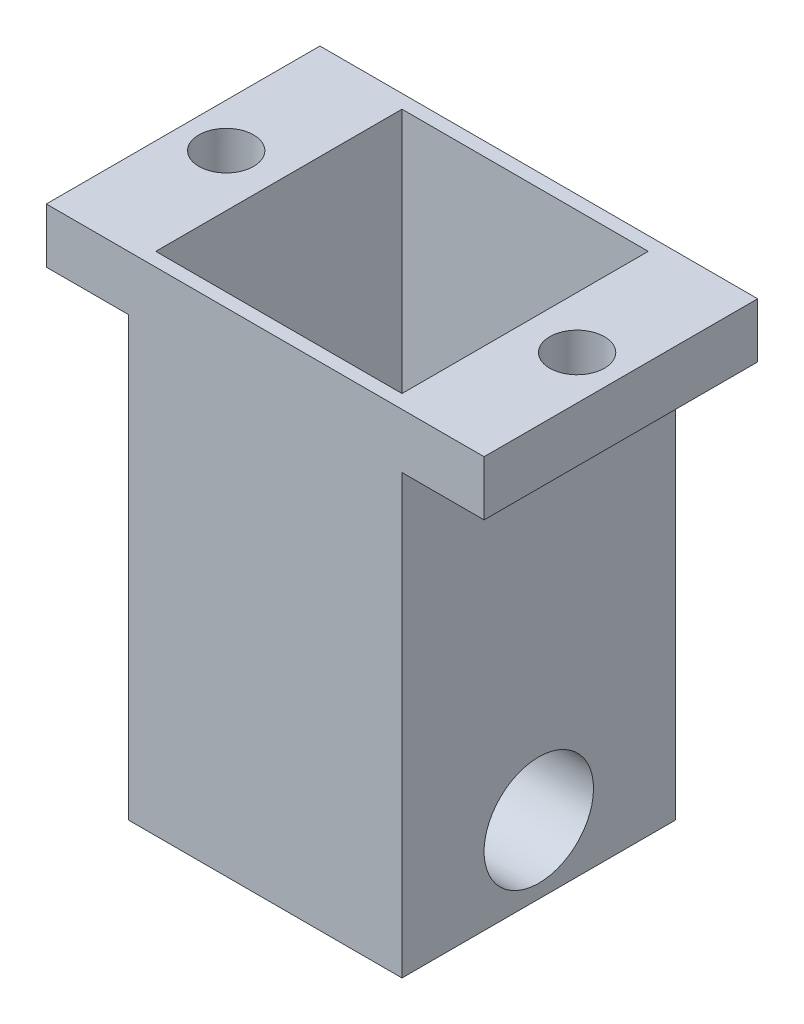
ISO-10303-21;
HEADER;
FILE_DESCRIPTION(('STEP AP214'),'2;1');
FILE_NAME('part.step','',(''),(''),'','','');
FILE_SCHEMA(('AUTOMOTIVE_DESIGN { 1 0 10303 214 1 1 1 1 }'));
ENDSEC;
DATA;
#1=APPLICATION_CONTEXT('core data for automotive mechanical design processes');
#2=APPLICATION_PROTOCOL_DEFINITION('international standard','automotive_design',2000,#1);
#3=PRODUCT_CONTEXT('',#1,'mechanical');
#4=PRODUCT('Part','Part','',(#3));
#5=PRODUCT_RELATED_PRODUCT_CATEGORY('part','',(#4));
#6=PRODUCT_DEFINITION_FORMATION('','',#4);
#7=PRODUCT_DEFINITION_CONTEXT('part definition',#1,'design');
#8=PRODUCT_DEFINITION('design','',#6,#7);
#9=PRODUCT_DEFINITION_SHAPE('','',#8);
#10=(LENGTH_UNIT() NAMED_UNIT(*) SI_UNIT(.MILLI.,.METRE.));
#11=(NAMED_UNIT(*) PLANE_ANGLE_UNIT() SI_UNIT($,.RADIAN.));
#12=(NAMED_UNIT(*) SI_UNIT($,.STERADIAN.) SOLID_ANGLE_UNIT());
#13=UNCERTAINTY_MEASURE_WITH_UNIT(LENGTH_MEASURE(1.E-05),#10,'distance_accuracy_value','');
#14=(GEOMETRIC_REPRESENTATION_CONTEXT(3) GLOBAL_UNCERTAINTY_ASSIGNED_CONTEXT((#13)) GLOBAL_UNIT_ASSIGNED_CONTEXT((#10,
#11,#12)) REPRESENTATION_CONTEXT('',''));
#15=CARTESIAN_POINT('',(0.,0.,0.));
#16=DIRECTION('',(0.,0.,1.));
#17=DIRECTION('',(1.,0.,0.));
#18=AXIS2_PLACEMENT_3D('',#15,#16,#17);
#19=CARTESIAN_POINT('',(0.,114.3,0.));
#20=DIRECTION('',(0.,-1.,0.));
#21=DIRECTION('',(0.,0.,-1.));
#22=AXIS2_PLACEMENT_3D('',#19,#20,#21);
#23=PLANE('',#22);
#24=CARTESIAN_POINT('',(72.39,114.3,-31.75));
#25=DIRECTION('',(0.,1.,0.));
#26=DIRECTION('',(0.,0.,1.));
#27=AXIS2_PLACEMENT_3D('',#24,#25,#26);
#28=CIRCLE('',#27,6.34999999999999);
#29=CARTESIAN_POINT('',(72.39,114.3,-25.4));
#30=VERTEX_POINT('',#29);
#31=EDGE_CURVE('E437',#30,#30,#28,.T.);
#32=ORIENTED_EDGE('',*,*,#31,.F.);
#33=EDGE_LOOP('',(#32));
#34=FACE_BOUND('',#33,.T.);
#35=DIRECTION('',(-1.,0.,0.));
#36=VECTOR('',#35,1.);
#37=CARTESIAN_POINT('',(0.,114.3,-63.5));
#38=LINE('',#37,#36);
#39=CARTESIAN_POINT('',(82.55,114.3,-63.5));
#40=VERTEX_POINT('',#39);
#41=CARTESIAN_POINT('',(-19.05,114.3,-63.5));
#42=VERTEX_POINT('',#41);
#43=EDGE_CURVE('E135',#40,#42,#38,.T.);
#44=ORIENTED_EDGE('',*,*,#43,.T.);
#45=DIRECTION('',(0.,0.,1.));
#46=VECTOR('',#45,1.);
#47=CARTESIAN_POINT('',(-19.05,114.3,0.));
#48=LINE('',#47,#46);
#49=CARTESIAN_POINT('',(-19.05,114.3,0.));
#50=VERTEX_POINT('',#49);
#51=EDGE_CURVE('E142',#42,#50,#48,.T.);
#52=ORIENTED_EDGE('',*,*,#51,.T.);
#53=DIRECTION('',(1.,0.,0.));
#54=VECTOR('',#53,1.);
#55=CARTESIAN_POINT('',(0.,114.3,0.));
#56=LINE('',#55,#54);
#57=CARTESIAN_POINT('',(82.55,114.3,0.));
#58=VERTEX_POINT('',#57);
#59=EDGE_CURVE('E122',#50,#58,#56,.T.);
#60=ORIENTED_EDGE('',*,*,#59,.T.);
#61=DIRECTION('',(0.,0.,1.));
#62=VECTOR('',#61,1.);
#63=CARTESIAN_POINT('',(82.55,114.3,0.));
#64=LINE('',#63,#62);
#65=EDGE_CURVE('E165',#40,#58,#64,.T.);
#66=ORIENTED_EDGE('',*,*,#65,.F.);
#67=EDGE_LOOP('',(#44,#52,#60,#66));
#68=FACE_BOUND('',#67,.T.);
#69=DIRECTION('',(0.,0.,1.));
#70=VECTOR('',#69,1.);
#71=CARTESIAN_POINT('',(3.175,114.3,-3.175));
#72=LINE('',#71,#70);
#73=CARTESIAN_POINT('',(3.175,114.3,-60.325));
#74=VERTEX_POINT('',#73);
#75=CARTESIAN_POINT('',(3.175,114.3,-3.175));
#76=VERTEX_POINT('',#75);
#77=EDGE_CURVE('E175',#74,#76,#72,.T.);
#78=ORIENTED_EDGE('',*,*,#77,.F.);
#79=DIRECTION('',(-1.,0.,0.));
#80=VECTOR('',#79,1.);
#81=CARTESIAN_POINT('',(3.175,114.3,-60.325));
#82=LINE('',#81,#80);
#83=CARTESIAN_POINT('',(60.325,114.3,-60.325));
#84=VERTEX_POINT('',#83);
#85=EDGE_CURVE('E183',#84,#74,#82,.T.);
#86=ORIENTED_EDGE('',*,*,#85,.F.);
#87=DIRECTION('',(0.,0.,-1.));
#88=VECTOR('',#87,1.);
#89=CARTESIAN_POINT('',(60.325,114.3,-3.175));
#90=LINE('',#89,#88);
#91=CARTESIAN_POINT('',(60.325,114.3,-3.175));
#92=VERTEX_POINT('',#91);
#93=EDGE_CURVE('E180',#92,#84,#90,.T.);
#94=ORIENTED_EDGE('',*,*,#93,.F.);
#95=DIRECTION('',(1.,0.,0.));
#96=VECTOR('',#95,1.);
#97=CARTESIAN_POINT('',(3.175,114.3,-3.175));
#98=LINE('',#97,#96);
#99=EDGE_CURVE('E177',#76,#92,#98,.T.);
#100=ORIENTED_EDGE('',*,*,#99,.F.);
#101=EDGE_LOOP('',(#78,#86,#94,#100));
#102=FACE_BOUND('',#101,.T.);
#103=CARTESIAN_POINT('',(-8.89,114.3,-31.5932831782035));
#104=DIRECTION('',(0.,1.,0.));
#105=DIRECTION('',(0.,0.,1.));
#106=AXIS2_PLACEMENT_3D('',#103,#104,#105);
#107=CIRCLE('',#106,6.35);
#108=CARTESIAN_POINT('',(-8.89,114.3,-25.2432831782035));
#109=VERTEX_POINT('',#108);
#110=EDGE_CURVE('E439',#109,#109,#107,.T.);
#111=ORIENTED_EDGE('',*,*,#110,.F.);
#112=EDGE_LOOP('',(#111));
#113=FACE_BOUND('',#112,.T.);
#114=ADVANCED_FACE('F33',(#34,#68,#102,#113),#23,.F.);
#115=CARTESIAN_POINT('',(63.5,31.75,0.));
#116=DIRECTION('',(-1.,0.,0.));
#117=DIRECTION('',(0.,0.,1.));
#118=AXIS2_PLACEMENT_3D('',#115,#116,#117);
#119=PLANE('',#118);
#120=CARTESIAN_POINT('',(63.5,15.875,-31.75));
#121=DIRECTION('',(1.,0.,0.));
#122=DIRECTION('',(0.,0.,-1.));
#123=AXIS2_PLACEMENT_3D('',#120,#121,#122);
#124=CIRCLE('',#123,12.7);
#125=CARTESIAN_POINT('',(63.5,15.875,-44.45));
#126=VERTEX_POINT('',#125);
#127=EDGE_CURVE('E447',#126,#126,#124,.T.);
#128=ORIENTED_EDGE('',*,*,#127,.F.);
#129=EDGE_LOOP('',(#128));
#130=FACE_BOUND('',#129,.T.);
#131=DIRECTION('',(0.,0.,-1.));
#132=VECTOR('',#131,1.);
#133=CARTESIAN_POINT('',(63.5,101.6,0.));
#134=LINE('',#133,#132);
#135=CARTESIAN_POINT('',(63.5,101.6,0.));
#136=VERTEX_POINT('',#135);
#137=CARTESIAN_POINT('',(63.5,101.6,-63.5));
#138=VERTEX_POINT('',#137);
#139=EDGE_CURVE('E56',#136,#138,#134,.T.);
#140=ORIENTED_EDGE('',*,*,#139,.F.);
#141=DIRECTION('',(0.,-1.,0.));
#142=VECTOR('',#141,1.);
#143=CARTESIAN_POINT('',(63.5,31.75,0.));
#144=LINE('',#143,#142);
#145=CARTESIAN_POINT('',(63.5,0.,0.));
#146=VERTEX_POINT('',#145);
#147=EDGE_CURVE('E41',#136,#146,#144,.T.);
#148=ORIENTED_EDGE('',*,*,#147,.T.);
#149=DIRECTION('',(0.,0.,-1.));
#150=VECTOR('',#149,1.);
#151=CARTESIAN_POINT('',(63.5,0.,0.));
#152=LINE('',#151,#150);
#153=CARTESIAN_POINT('',(63.5,0.,-63.5));
#154=VERTEX_POINT('',#153);
#155=EDGE_CURVE('E209',#146,#154,#152,.T.);
#156=ORIENTED_EDGE('',*,*,#155,.T.);
#157=DIRECTION('',(0.,-1.,0.));
#158=VECTOR('',#157,1.);
#159=CARTESIAN_POINT('',(63.5,31.75,-63.5));
#160=LINE('',#159,#158);
#161=EDGE_CURVE('E217',#138,#154,#160,.T.);
#162=ORIENTED_EDGE('',*,*,#161,.F.);
#163=EDGE_LOOP('',(#140,#148,#156,#162));
#164=FACE_BOUND('',#163,.T.);
#165=ADVANCED_FACE('F218',(#130,#164),#119,.F.);
#166=CARTESIAN_POINT('',(0.,31.75,0.));
#167=DIRECTION('',(1.,0.,0.));
#168=DIRECTION('',(0.,0.,-1.));
#169=AXIS2_PLACEMENT_3D('',#166,#167,#168);
#170=PLANE('',#169);
#171=CARTESIAN_POINT('',(0.,15.875,-31.75));
#172=DIRECTION('',(1.,0.,0.));
#173=DIRECTION('',(0.,0.,-1.));
#174=AXIS2_PLACEMENT_3D('',#171,#172,#173);
#175=CIRCLE('',#174,12.7);
#176=CARTESIAN_POINT('',(0.,15.875,-44.45));
#177=VERTEX_POINT('',#176);
#178=EDGE_CURVE('E156',#177,#177,#175,.T.);
#179=ORIENTED_EDGE('',*,*,#178,.T.);
#180=EDGE_LOOP('',(#179));
#181=FACE_BOUND('',#180,.T.);
#182=DIRECTION('',(0.,-1.,0.));
#183=VECTOR('',#182,1.);
#184=CARTESIAN_POINT('',(0.,31.75,0.));
#185=LINE('',#184,#183);
#186=CARTESIAN_POINT('',(0.,101.6,0.));
#187=VERTEX_POINT('',#186);
#188=CARTESIAN_POINT('',(0.,0.,0.));
#189=VERTEX_POINT('',#188);
#190=EDGE_CURVE('E11',#187,#189,#185,.T.);
#191=ORIENTED_EDGE('',*,*,#190,.F.);
#192=DIRECTION('',(0.,0.,-1.));
#193=VECTOR('',#192,1.);
#194=CARTESIAN_POINT('',(0.,101.6,0.));
#195=LINE('',#194,#193);
#196=CARTESIAN_POINT('',(0.,101.6,-63.5));
#197=VERTEX_POINT('',#196);
#198=EDGE_CURVE('E145',#187,#197,#195,.T.);
#199=ORIENTED_EDGE('',*,*,#198,.T.);
#200=DIRECTION('',(0.,-1.,0.));
#201=VECTOR('',#200,1.);
#202=CARTESIAN_POINT('',(0.,31.75,-63.5));
#203=LINE('',#202,#201);
#204=CARTESIAN_POINT('',(0.,0.,-63.5));
#205=VERTEX_POINT('',#204);
#206=EDGE_CURVE('E215',#197,#205,#203,.T.);
#207=ORIENTED_EDGE('',*,*,#206,.T.);
#208=DIRECTION('',(0.,0.,1.));
#209=VECTOR('',#208,1.);
#210=CARTESIAN_POINT('',(0.,0.,0.));
#211=LINE('',#210,#209);
#212=EDGE_CURVE('E204',#205,#189,#211,.T.);
#213=ORIENTED_EDGE('',*,*,#212,.T.);
#214=EDGE_LOOP('',(#191,#199,#207,#213));
#215=FACE_BOUND('',#214,.T.);
#216=ADVANCED_FACE('F35',(#181,#215),#170,.F.);
#217=CARTESIAN_POINT('',(0.,31.75,0.));
#218=DIRECTION('',(0.,0.,-1.));
#219=DIRECTION('',(-1.,0.,0.));
#220=AXIS2_PLACEMENT_3D('',#217,#218,#219);
#221=PLANE('',#220);
#222=DIRECTION('',(1.,0.,0.));
#223=VECTOR('',#222,1.);
#224=CARTESIAN_POINT('',(0.,0.,0.));
#225=LINE('',#224,#223);
#226=EDGE_CURVE('E207',#189,#146,#225,.T.);
#227=ORIENTED_EDGE('',*,*,#226,.T.);
#228=ORIENTED_EDGE('',*,*,#147,.F.);
#229=DIRECTION('',(-1.,0.,0.));
#230=VECTOR('',#229,1.);
#231=CARTESIAN_POINT('',(82.55,101.6,0.));
#232=LINE('',#231,#230);
#233=CARTESIAN_POINT('',(82.55,101.6,0.));
#234=VERTEX_POINT('',#233);
#235=EDGE_CURVE('E171',#234,#136,#232,.T.);
#236=ORIENTED_EDGE('',*,*,#235,.F.);
#237=DIRECTION('',(0.,-1.,0.));
#238=VECTOR('',#237,1.);
#239=CARTESIAN_POINT('',(82.55,114.3,0.));
#240=LINE('',#239,#238);
#241=EDGE_CURVE('E130',#58,#234,#240,.T.);
#242=ORIENTED_EDGE('',*,*,#241,.F.);
#243=ORIENTED_EDGE('',*,*,#59,.F.);
#244=DIRECTION('',(0.,-1.,0.));
#245=VECTOR('',#244,1.);
#246=CARTESIAN_POINT('',(-19.05,114.3,0.));
#247=LINE('',#246,#245);
#248=CARTESIAN_POINT('',(-19.05,101.6,0.));
#249=VERTEX_POINT('',#248);
#250=EDGE_CURVE('E126',#50,#249,#247,.T.);
#251=ORIENTED_EDGE('',*,*,#250,.T.);
#252=DIRECTION('',(1.,0.,0.));
#253=VECTOR('',#252,1.);
#254=CARTESIAN_POINT('',(-19.05,101.6,0.));
#255=LINE('',#254,#253);
#256=EDGE_CURVE('E154',#249,#187,#255,.T.);
#257=ORIENTED_EDGE('',*,*,#256,.T.);
#258=ORIENTED_EDGE('',*,*,#190,.T.);
#259=EDGE_LOOP('',(#227,#228,#236,#242,#243,#251,#257,#258));
#260=FACE_BOUND('',#259,.T.);
#261=ADVANCED_FACE('F125',(#260),#221,.F.);
#262=CARTESIAN_POINT('',(0.,31.75,-63.5));
#263=DIRECTION('',(0.,0.,1.));
#264=DIRECTION('',(1.,0.,0.));
#265=AXIS2_PLACEMENT_3D('',#262,#263,#264);
#266=PLANE('',#265);
#267=DIRECTION('',(-1.,0.,0.));
#268=VECTOR('',#267,1.);
#269=CARTESIAN_POINT('',(0.,0.,-63.5));
#270=LINE('',#269,#268);
#271=EDGE_CURVE('E212',#154,#205,#270,.T.);
#272=ORIENTED_EDGE('',*,*,#271,.T.);
#273=ORIENTED_EDGE('',*,*,#206,.F.);
#274=DIRECTION('',(1.,0.,0.));
#275=VECTOR('',#274,1.);
#276=CARTESIAN_POINT('',(-19.05,101.6,-63.5));
#277=LINE('',#276,#275);
#278=CARTESIAN_POINT('',(-19.05,101.6,-63.5));
#279=VERTEX_POINT('',#278);
#280=EDGE_CURVE('E48',#279,#197,#277,.T.);
#281=ORIENTED_EDGE('',*,*,#280,.F.);
#282=DIRECTION('',(0.,1.,0.));
#283=VECTOR('',#282,1.);
#284=CARTESIAN_POINT('',(-19.05,114.3,-63.5));
#285=LINE('',#284,#283);
#286=EDGE_CURVE('E148',#279,#42,#285,.T.);
#287=ORIENTED_EDGE('',*,*,#286,.T.);
#288=ORIENTED_EDGE('',*,*,#43,.F.);
#289=DIRECTION('',(0.,1.,0.));
#290=VECTOR('',#289,1.);
#291=CARTESIAN_POINT('',(82.55,114.3,-63.5));
#292=LINE('',#291,#290);
#293=CARTESIAN_POINT('',(82.55,101.6,-63.5));
#294=VERTEX_POINT('',#293);
#295=EDGE_CURVE('E162',#294,#40,#292,.T.);
#296=ORIENTED_EDGE('',*,*,#295,.F.);
#297=DIRECTION('',(-1.,0.,0.));
#298=VECTOR('',#297,1.);
#299=CARTESIAN_POINT('',(82.55,101.6,-63.5));
#300=LINE('',#299,#298);
#301=EDGE_CURVE('E167',#294,#138,#300,.T.);
#302=ORIENTED_EDGE('',*,*,#301,.T.);
#303=ORIENTED_EDGE('',*,*,#161,.T.);
#304=EDGE_LOOP('',(#272,#273,#281,#287,#288,#296,#302,#303));
#305=FACE_BOUND('',#304,.T.);
#306=ADVANCED_FACE('F228',(#305),#266,.F.);
#307=CARTESIAN_POINT('',(0.,0.,0.));
#308=DIRECTION('',(0.,-1.,0.));
#309=DIRECTION('',(0.,0.,-1.));
#310=AXIS2_PLACEMENT_3D('',#307,#308,#309);
#311=PLANE('',#310);
#312=ORIENTED_EDGE('',*,*,#212,.F.);
#313=ORIENTED_EDGE('',*,*,#271,.F.);
#314=ORIENTED_EDGE('',*,*,#155,.F.);
#315=ORIENTED_EDGE('',*,*,#226,.F.);
#316=EDGE_LOOP('',(#312,#313,#314,#315));
#317=FACE_BOUND('',#316,.T.);
#318=ADVANCED_FACE('F225',(#317),#311,.T.);
#319=CARTESIAN_POINT('',(3.175,114.3,-3.175));
#320=DIRECTION('',(1.,0.,0.));
#321=DIRECTION('',(0.,0.,-1.));
#322=AXIS2_PLACEMENT_3D('',#319,#320,#321);
#323=PLANE('',#322);
#324=DIRECTION('',(0.,0.,1.));
#325=VECTOR('',#324,1.);
#326=CARTESIAN_POINT('',(3.175,31.75,-3.175));
#327=LINE('',#326,#325);
#328=CARTESIAN_POINT('',(3.175,31.75,-60.325));
#329=VERTEX_POINT('',#328);
#330=CARTESIAN_POINT('',(3.175,31.75,-3.175));
#331=VERTEX_POINT('',#330);
#332=EDGE_CURVE('E174',#329,#331,#327,.T.);
#333=ORIENTED_EDGE('',*,*,#332,.F.);
#334=DIRECTION('',(0.,-1.,0.));
#335=VECTOR('',#334,1.);
#336=CARTESIAN_POINT('',(3.175,114.3,-60.325));
#337=LINE('',#336,#335);
#338=EDGE_CURVE('E185',#74,#329,#337,.T.);
#339=ORIENTED_EDGE('',*,*,#338,.F.);
#340=ORIENTED_EDGE('',*,*,#77,.T.);
#341=DIRECTION('',(0.,-1.,0.));
#342=VECTOR('',#341,1.);
#343=CARTESIAN_POINT('',(3.175,114.3,-3.175));
#344=LINE('',#343,#342);
#345=EDGE_CURVE('E136',#76,#331,#344,.T.);
#346=ORIENTED_EDGE('',*,*,#345,.T.);
#347=EDGE_LOOP('',(#333,#339,#340,#346));
#348=FACE_BOUND('',#347,.T.);
#349=ADVANCED_FACE('F254',(#348),#323,.T.);
#350=CARTESIAN_POINT('',(3.175,114.3,-3.175));
#351=DIRECTION('',(0.,0.,-1.));
#352=DIRECTION('',(-1.,0.,0.));
#353=AXIS2_PLACEMENT_3D('',#350,#351,#352);
#354=PLANE('',#353);
#355=DIRECTION('',(1.,0.,0.));
#356=VECTOR('',#355,1.);
#357=CARTESIAN_POINT('',(3.175,31.75,-3.175));
#358=LINE('',#357,#356);
#359=CARTESIAN_POINT('',(60.325,31.75,-3.175));
#360=VERTEX_POINT('',#359);
#361=EDGE_CURVE('E188',#331,#360,#358,.T.);
#362=ORIENTED_EDGE('',*,*,#361,.F.);
#363=ORIENTED_EDGE('',*,*,#345,.F.);
#364=ORIENTED_EDGE('',*,*,#99,.T.);
#365=DIRECTION('',(0.,-1.,0.));
#366=VECTOR('',#365,1.);
#367=CARTESIAN_POINT('',(60.325,114.3,-3.175));
#368=LINE('',#367,#366);
#369=EDGE_CURVE('E199',#92,#360,#368,.T.);
#370=ORIENTED_EDGE('',*,*,#369,.T.);
#371=EDGE_LOOP('',(#362,#363,#364,#370));
#372=FACE_BOUND('',#371,.T.);
#373=ADVANCED_FACE('F279',(#372),#354,.T.);
#374=CARTESIAN_POINT('',(60.325,114.3,-3.175));
#375=DIRECTION('',(-1.,0.,0.));
#376=DIRECTION('',(0.,0.,1.));
#377=AXIS2_PLACEMENT_3D('',#374,#375,#376);
#378=PLANE('',#377);
#379=DIRECTION('',(0.,0.,-1.));
#380=VECTOR('',#379,1.);
#381=CARTESIAN_POINT('',(60.325,31.75,-3.175));
#382=LINE('',#381,#380);
#383=CARTESIAN_POINT('',(60.325,31.75,-60.325));
#384=VERTEX_POINT('',#383);
#385=EDGE_CURVE('E191',#360,#384,#382,.T.);
#386=ORIENTED_EDGE('',*,*,#385,.F.);
#387=ORIENTED_EDGE('',*,*,#369,.F.);
#388=ORIENTED_EDGE('',*,*,#93,.T.);
#389=DIRECTION('',(0.,-1.,0.));
#390=VECTOR('',#389,1.);
#391=CARTESIAN_POINT('',(60.325,114.3,-60.325));
#392=LINE('',#391,#390);
#393=EDGE_CURVE('E197',#84,#384,#392,.T.);
#394=ORIENTED_EDGE('',*,*,#393,.T.);
#395=EDGE_LOOP('',(#386,#387,#388,#394));
#396=FACE_BOUND('',#395,.T.);
#397=ADVANCED_FACE('F286',(#396),#378,.T.);
#398=CARTESIAN_POINT('',(3.175,114.3,-60.325));
#399=DIRECTION('',(0.,0.,1.));
#400=DIRECTION('',(1.,0.,0.));
#401=AXIS2_PLACEMENT_3D('',#398,#399,#400);
#402=PLANE('',#401);
#403=DIRECTION('',(-1.,0.,0.));
#404=VECTOR('',#403,1.);
#405=CARTESIAN_POINT('',(3.175,31.75,-60.325));
#406=LINE('',#405,#404);
#407=EDGE_CURVE('E178',#384,#329,#406,.T.);
#408=ORIENTED_EDGE('',*,*,#407,.F.);
#409=ORIENTED_EDGE('',*,*,#393,.F.);
#410=ORIENTED_EDGE('',*,*,#85,.T.);
#411=ORIENTED_EDGE('',*,*,#338,.T.);
#412=EDGE_LOOP('',(#408,#409,#410,#411));
#413=FACE_BOUND('',#412,.T.);
#414=ADVANCED_FACE('F259',(#413),#402,.T.);
#415=CARTESIAN_POINT('',(0.,31.75,0.));
#416=DIRECTION('',(0.,-1.,0.));
#417=DIRECTION('',(0.,0.,-1.));
#418=AXIS2_PLACEMENT_3D('',#415,#416,#417);
#419=PLANE('',#418);
#420=ORIENTED_EDGE('',*,*,#407,.T.);
#421=ORIENTED_EDGE('',*,*,#332,.T.);
#422=ORIENTED_EDGE('',*,*,#361,.T.);
#423=ORIENTED_EDGE('',*,*,#385,.T.);
#424=EDGE_LOOP('',(#420,#421,#422,#423));
#425=FACE_BOUND('',#424,.T.);
#426=ADVANCED_FACE('F256',(#425),#419,.F.);
#427=CARTESIAN_POINT('',(82.55,101.6,0.));
#428=DIRECTION('',(0.,1.,0.));
#429=DIRECTION('',(0.,0.,1.));
#430=AXIS2_PLACEMENT_3D('',#427,#428,#429);
#431=PLANE('',#430);
#432=CARTESIAN_POINT('',(72.39,101.6,-31.75));
#433=DIRECTION('',(0.,1.,0.));
#434=DIRECTION('',(0.,0.,1.));
#435=AXIS2_PLACEMENT_3D('',#432,#433,#434);
#436=CIRCLE('',#435,6.34999999999999);
#437=CARTESIAN_POINT('',(72.39,101.6,-25.4));
#438=VERTEX_POINT('',#437);
#439=EDGE_CURVE('E435',#438,#438,#436,.T.);
#440=ORIENTED_EDGE('',*,*,#439,.T.);
#441=EDGE_LOOP('',(#440));
#442=FACE_BOUND('',#441,.T.);
#443=ORIENTED_EDGE('',*,*,#139,.T.);
#444=ORIENTED_EDGE('',*,*,#301,.F.);
#445=DIRECTION('',(0.,0.,-1.));
#446=VECTOR('',#445,1.);
#447=CARTESIAN_POINT('',(82.55,101.6,0.));
#448=LINE('',#447,#446);
#449=EDGE_CURVE('E160',#234,#294,#448,.T.);
#450=ORIENTED_EDGE('',*,*,#449,.F.);
#451=ORIENTED_EDGE('',*,*,#235,.T.);
#452=EDGE_LOOP('',(#443,#444,#450,#451));
#453=FACE_BOUND('',#452,.T.);
#454=ADVANCED_FACE('F232',(#442,#453),#431,.F.);
#455=CARTESIAN_POINT('',(82.55,0.,0.));
#456=DIRECTION('',(1.,0.,0.));
#457=DIRECTION('',(0.,0.,-1.));
#458=AXIS2_PLACEMENT_3D('',#455,#456,#457);
#459=PLANE('',#458);
#460=ORIENTED_EDGE('',*,*,#241,.T.);
#461=ORIENTED_EDGE('',*,*,#449,.T.);
#462=ORIENTED_EDGE('',*,*,#295,.T.);
#463=ORIENTED_EDGE('',*,*,#65,.T.);
#464=EDGE_LOOP('',(#460,#461,#462,#463));
#465=FACE_BOUND('',#464,.T.);
#466=ADVANCED_FACE('F234',(#465),#459,.T.);
#467=CARTESIAN_POINT('',(-19.05,101.6,0.));
#468=DIRECTION('',(0.,-1.,0.));
#469=DIRECTION('',(0.,0.,-1.));
#470=AXIS2_PLACEMENT_3D('',#467,#468,#469);
#471=PLANE('',#470);
#472=CARTESIAN_POINT('',(-8.89,101.6,-31.5932831782035));
#473=DIRECTION('',(0.,-1.,0.));
#474=DIRECTION('',(0.,0.,-1.));
#475=AXIS2_PLACEMENT_3D('',#472,#473,#474);
#476=CIRCLE('',#475,6.35);
#477=CARTESIAN_POINT('',(-8.89,101.6,-37.9432831782035));
#478=VERTEX_POINT('',#477);
#479=EDGE_CURVE('E444',#478,#478,#476,.T.);
#480=ORIENTED_EDGE('',*,*,#479,.F.);
#481=EDGE_LOOP('',(#480));
#482=FACE_BOUND('',#481,.T.);
#483=ORIENTED_EDGE('',*,*,#198,.F.);
#484=ORIENTED_EDGE('',*,*,#256,.F.);
#485=DIRECTION('',(0.,0.,-1.));
#486=VECTOR('',#485,1.);
#487=CARTESIAN_POINT('',(-19.05,101.6,0.));
#488=LINE('',#487,#486);
#489=EDGE_CURVE('E144',#249,#279,#488,.T.);
#490=ORIENTED_EDGE('',*,*,#489,.T.);
#491=ORIENTED_EDGE('',*,*,#280,.T.);
#492=EDGE_LOOP('',(#483,#484,#490,#491));
#493=FACE_BOUND('',#492,.T.);
#494=ADVANCED_FACE('F235',(#482,#493),#471,.T.);
#495=CARTESIAN_POINT('',(-19.05,0.,0.));
#496=DIRECTION('',(-1.,0.,0.));
#497=DIRECTION('',(0.,0.,-1.));
#498=AXIS2_PLACEMENT_3D('',#495,#496,#497);
#499=PLANE('',#498);
#500=ORIENTED_EDGE('',*,*,#250,.F.);
#501=ORIENTED_EDGE('',*,*,#51,.F.);
#502=ORIENTED_EDGE('',*,*,#286,.F.);
#503=ORIENTED_EDGE('',*,*,#489,.F.);
#504=EDGE_LOOP('',(#500,#501,#502,#503));
#505=FACE_BOUND('',#504,.T.);
#506=ADVANCED_FACE('F140',(#505),#499,.T.);
#507=CARTESIAN_POINT('',(63.5,15.875,-31.75));
#508=DIRECTION('',(1.,0.,0.));
#509=DIRECTION('',(0.,0.,-1.));
#510=AXIS2_PLACEMENT_3D('',#507,#508,#509);
#511=CYLINDRICAL_SURFACE('',#510,12.7);
#512=ORIENTED_EDGE('',*,*,#178,.F.);
#513=EDGE_LOOP('',(#512));
#514=FACE_BOUND('',#513,.T.);
#515=ORIENTED_EDGE('',*,*,#127,.T.);
#516=EDGE_LOOP('',(#515));
#517=FACE_BOUND('',#516,.T.);
#518=ADVANCED_FACE('F331',(#514,#517),#511,.F.);
#519=CARTESIAN_POINT('',(-8.89,114.3,-31.5932831782035));
#520=DIRECTION('',(0.,1.,0.));
#521=DIRECTION('',(0.,0.,1.));
#522=AXIS2_PLACEMENT_3D('',#519,#520,#521);
#523=CYLINDRICAL_SURFACE('',#522,6.35);
#524=ORIENTED_EDGE('',*,*,#110,.T.);
#525=EDGE_LOOP('',(#524));
#526=FACE_BOUND('',#525,.T.);
#527=ORIENTED_EDGE('',*,*,#479,.T.);
#528=EDGE_LOOP('',(#527));
#529=FACE_BOUND('',#528,.T.);
#530=ADVANCED_FACE('F339',(#526,#529),#523,.F.);
#531=CARTESIAN_POINT('',(72.39,114.3,-31.75));
#532=DIRECTION('',(0.,1.,0.));
#533=DIRECTION('',(0.,0.,1.));
#534=AXIS2_PLACEMENT_3D('',#531,#532,#533);
#535=CYLINDRICAL_SURFACE('',#534,6.34999999999999);
#536=ORIENTED_EDGE('',*,*,#439,.F.);
#537=EDGE_LOOP('',(#536));
#538=FACE_BOUND('',#537,.T.);
#539=ORIENTED_EDGE('',*,*,#31,.T.);
#540=EDGE_LOOP('',(#539));
#541=FACE_BOUND('',#540,.T.);
#542=ADVANCED_FACE('F346',(#538,#541),#535,.F.);
#543=CLOSED_SHELL('',(#114,#165,#216,#261,#306,#318,#349,#373,#397,#414,#426,#454,#466,#494,
#506,#518,#530,#542));
#544=MANIFOLD_SOLID_BREP('B2',#543);
#545=ADVANCED_BREP_SHAPE_REPRESENTATION('',(#18,#544),#14);
#546=SHAPE_DEFINITION_REPRESENTATION(#9,#545);
ENDSEC;
END-ISO-10303-21;
